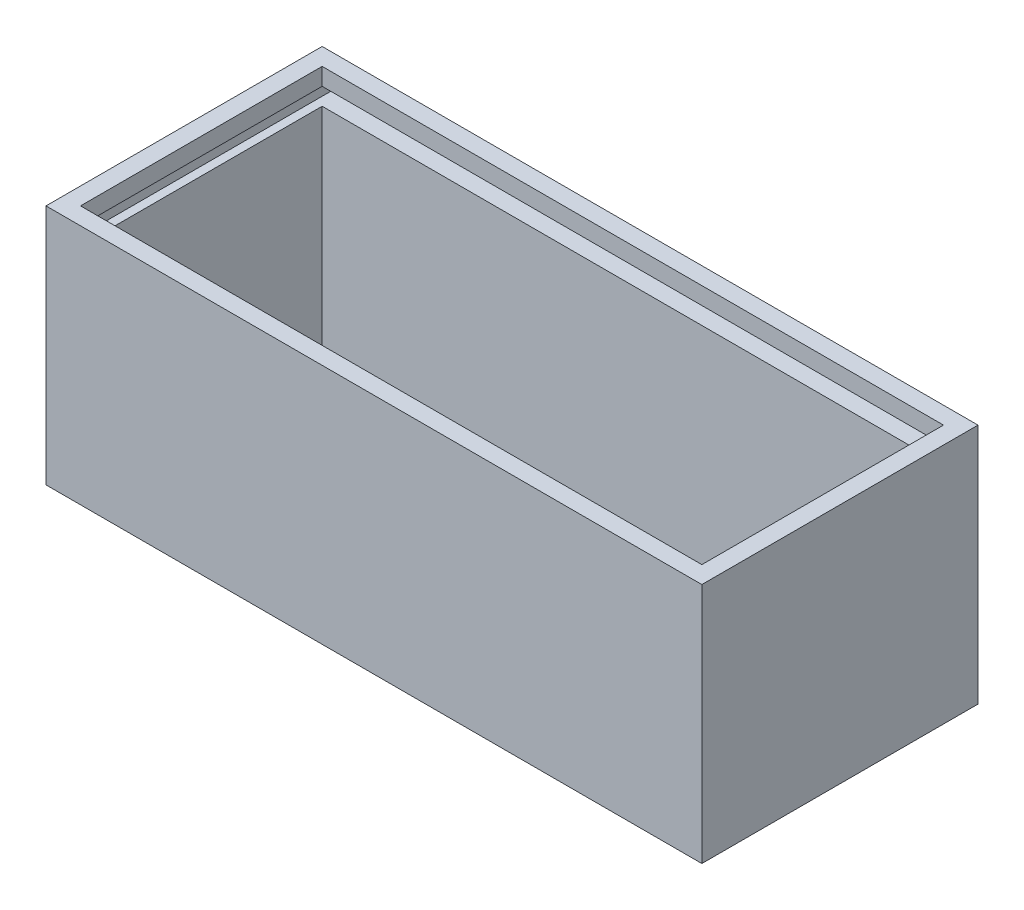
ISO-10303-21;
HEADER;
FILE_DESCRIPTION(('STEP AP214'),'2;1');
FILE_NAME('part.step','',(''),(''),'','','');
FILE_SCHEMA(('AUTOMOTIVE_DESIGN { 1 0 10303 214 1 1 1 1 }'));
ENDSEC;
DATA;
#1=APPLICATION_CONTEXT('core data for automotive mechanical design processes');
#2=APPLICATION_PROTOCOL_DEFINITION('international standard','automotive_design',2000,#1);
#3=PRODUCT_CONTEXT('',#1,'mechanical');
#4=PRODUCT('Part','Part','',(#3));
#5=PRODUCT_RELATED_PRODUCT_CATEGORY('part','',(#4));
#6=PRODUCT_DEFINITION_FORMATION('','',#4);
#7=PRODUCT_DEFINITION_CONTEXT('part definition',#1,'design');
#8=PRODUCT_DEFINITION('design','',#6,#7);
#9=PRODUCT_DEFINITION_SHAPE('','',#8);
#10=(LENGTH_UNIT() NAMED_UNIT(*) SI_UNIT(.MILLI.,.METRE.));
#11=(NAMED_UNIT(*) PLANE_ANGLE_UNIT() SI_UNIT($,.RADIAN.));
#12=(NAMED_UNIT(*) SI_UNIT($,.STERADIAN.) SOLID_ANGLE_UNIT());
#13=UNCERTAINTY_MEASURE_WITH_UNIT(LENGTH_MEASURE(1.E-05),#10,'distance_accuracy_value','');
#14=(GEOMETRIC_REPRESENTATION_CONTEXT(3) GLOBAL_UNCERTAINTY_ASSIGNED_CONTEXT((#13)) GLOBAL_UNIT_ASSIGNED_CONTEXT((#10,
#11,#12)) REPRESENTATION_CONTEXT('',''));
#15=CARTESIAN_POINT('',(0.,0.,0.));
#16=DIRECTION('',(0.,0.,1.));
#17=DIRECTION('',(1.,0.,0.));
#18=AXIS2_PLACEMENT_3D('',#15,#16,#17);
#19=CARTESIAN_POINT('',(0.,70.,-75.));
#20=DIRECTION('',(0.,0.,-1.));
#21=DIRECTION('',(-1.,0.,0.));
#22=AXIS2_PLACEMENT_3D('',#19,#20,#21);
#23=PLANE('',#22);
#24=DIRECTION('',(-1.,0.,0.));
#25=VECTOR('',#24,1.);
#26=CARTESIAN_POINT('',(0.,65.,-75.));
#27=LINE('',#26,#25);
#28=CARTESIAN_POINT('',(185.,65.,-75.));
#29=VERTEX_POINT('',#28);
#30=CARTESIAN_POINT('',(5.,65.,-75.));
#31=VERTEX_POINT('',#30);
#32=EDGE_CURVE('E213',#29,#31,#27,.T.);
#33=ORIENTED_EDGE('',*,*,#32,.F.);
#34=DIRECTION('',(0.,-1.,0.));
#35=VECTOR('',#34,1.);
#36=CARTESIAN_POINT('',(185.,70.,-75.));
#37=LINE('',#36,#35);
#38=CARTESIAN_POINT('',(185.,70.,-75.));
#39=VERTEX_POINT('',#38);
#40=EDGE_CURVE('E297',#39,#29,#37,.T.);
#41=ORIENTED_EDGE('',*,*,#40,.F.);
#42=DIRECTION('',(1.,0.,0.));
#43=VECTOR('',#42,1.);
#44=CARTESIAN_POINT('',(0.,70.,-75.));
#45=LINE('',#44,#43);
#46=CARTESIAN_POINT('',(5.,70.,-75.));
#47=VERTEX_POINT('',#46);
#48=EDGE_CURVE('E236',#47,#39,#45,.T.);
#49=ORIENTED_EDGE('',*,*,#48,.F.);
#50=DIRECTION('',(0.,-1.,0.));
#51=VECTOR('',#50,1.);
#52=CARTESIAN_POINT('',(5.,70.,-75.));
#53=LINE('',#52,#51);
#54=EDGE_CURVE('E282',#47,#31,#53,.T.);
#55=ORIENTED_EDGE('',*,*,#54,.T.);
#56=EDGE_LOOP('',(#33,#41,#49,#55));
#57=FACE_BOUND('',#56,.T.);
#58=ADVANCED_FACE('F39',(#57),#23,.F.);
#59=CARTESIAN_POINT('',(185.,70.,0.));
#60=DIRECTION('',(1.,0.,0.));
#61=DIRECTION('',(0.,0.,-1.));
#62=AXIS2_PLACEMENT_3D('',#59,#60,#61);
#63=PLANE('',#62);
#64=DIRECTION('',(0.,0.,-1.));
#65=VECTOR('',#64,1.);
#66=CARTESIAN_POINT('',(185.,65.,0.));
#67=LINE('',#66,#65);
#68=CARTESIAN_POINT('',(185.,65.,-5.));
#69=VERTEX_POINT('',#68);
#70=EDGE_CURVE('E216',#69,#29,#67,.T.);
#71=ORIENTED_EDGE('',*,*,#70,.F.);
#72=DIRECTION('',(0.,-1.,0.));
#73=VECTOR('',#72,1.);
#74=CARTESIAN_POINT('',(185.,70.,-5.));
#75=LINE('',#74,#73);
#76=CARTESIAN_POINT('',(185.,70.,-5.));
#77=VERTEX_POINT('',#76);
#78=EDGE_CURVE('E293',#77,#69,#75,.T.);
#79=ORIENTED_EDGE('',*,*,#78,.F.);
#80=DIRECTION('',(0.,0.,1.));
#81=VECTOR('',#80,1.);
#82=CARTESIAN_POINT('',(185.,70.,0.));
#83=LINE('',#82,#81);
#84=EDGE_CURVE('E240',#39,#77,#83,.T.);
#85=ORIENTED_EDGE('',*,*,#84,.F.);
#86=ORIENTED_EDGE('',*,*,#40,.T.);
#87=EDGE_LOOP('',(#71,#79,#85,#86));
#88=FACE_BOUND('',#87,.T.);
#89=ADVANCED_FACE('F353',(#88),#63,.F.);
#90=CARTESIAN_POINT('',(5.,70.,0.));
#91=DIRECTION('',(1.,0.,0.));
#92=DIRECTION('',(0.,0.,-1.));
#93=AXIS2_PLACEMENT_3D('',#90,#91,#92);
#94=PLANE('',#93);
#95=DIRECTION('',(0.,-1.,0.));
#96=VECTOR('',#95,1.);
#97=CARTESIAN_POINT('',(5.,70.,-5.));
#98=LINE('',#97,#96);
#99=CARTESIAN_POINT('',(5.,70.,-5.));
#100=VERTEX_POINT('',#99);
#101=CARTESIAN_POINT('',(5.,65.,-5.));
#102=VERTEX_POINT('',#101);
#103=EDGE_CURVE('E288',#100,#102,#98,.T.);
#104=ORIENTED_EDGE('',*,*,#103,.T.);
#105=DIRECTION('',(0.,0.,-1.));
#106=VECTOR('',#105,1.);
#107=CARTESIAN_POINT('',(5.,65.,0.));
#108=LINE('',#107,#106);
#109=EDGE_CURVE('E11',#102,#31,#108,.T.);
#110=ORIENTED_EDGE('',*,*,#109,.T.);
#111=ORIENTED_EDGE('',*,*,#54,.F.);
#112=DIRECTION('',(0.,0.,1.));
#113=VECTOR('',#112,1.);
#114=CARTESIAN_POINT('',(5.,70.,0.));
#115=LINE('',#114,#113);
#116=EDGE_CURVE('E247',#47,#100,#115,.T.);
#117=ORIENTED_EDGE('',*,*,#116,.T.);
#118=EDGE_LOOP('',(#104,#110,#111,#117));
#119=FACE_BOUND('',#118,.T.);
#120=ADVANCED_FACE('F359',(#119),#94,.T.);
#121=CARTESIAN_POINT('',(185.,60.,-75.));
#122=VERTEX_POINT('',#121);
#123=CARTESIAN_POINT('',(185.,0.,-75.));
#124=VERTEX_POINT('',#123);
#125=EDGE_CURVE('E296',#122,#124,#37,.T.);
#126=ORIENTED_EDGE('',*,*,#125,.F.);
#127=DIRECTION('',(-1.,0.,0.));
#128=VECTOR('',#127,1.);
#129=CARTESIAN_POINT('',(0.,60.,-75.));
#130=LINE('',#129,#128);
#131=CARTESIAN_POINT('',(5.,60.,-75.));
#132=VERTEX_POINT('',#131);
#133=EDGE_CURVE('E202',#122,#132,#130,.T.);
#134=ORIENTED_EDGE('',*,*,#133,.T.);
#135=CARTESIAN_POINT('',(5.,0.,-75.));
#136=VERTEX_POINT('',#135);
#137=EDGE_CURVE('E287',#132,#136,#53,.T.);
#138=ORIENTED_EDGE('',*,*,#137,.T.);
#139=DIRECTION('',(1.,0.,0.));
#140=VECTOR('',#139,1.);
#141=CARTESIAN_POINT('',(0.,0.,-75.));
#142=LINE('',#141,#140);
#143=EDGE_CURVE('E267',#136,#124,#142,.T.);
#144=ORIENTED_EDGE('',*,*,#143,.T.);
#145=EDGE_LOOP('',(#126,#134,#138,#144));
#146=FACE_BOUND('',#145,.T.);
#147=ADVANCED_FACE('F318',(#146),#23,.F.);
#148=CARTESIAN_POINT('',(185.,60.,-5.));
#149=VERTEX_POINT('',#148);
#150=CARTESIAN_POINT('',(185.,0.,-5.));
#151=VERTEX_POINT('',#150);
#152=EDGE_CURVE('E292',#149,#151,#75,.T.);
#153=ORIENTED_EDGE('',*,*,#152,.F.);
#154=DIRECTION('',(0.,0.,-1.));
#155=VECTOR('',#154,1.);
#156=CARTESIAN_POINT('',(185.,60.,0.));
#157=LINE('',#156,#155);
#158=EDGE_CURVE('E167',#149,#122,#157,.T.);
#159=ORIENTED_EDGE('',*,*,#158,.T.);
#160=ORIENTED_EDGE('',*,*,#125,.T.);
#161=DIRECTION('',(0.,0.,1.));
#162=VECTOR('',#161,1.);
#163=CARTESIAN_POINT('',(185.,0.,0.));
#164=LINE('',#163,#162);
#165=EDGE_CURVE('E271',#124,#151,#164,.T.);
#166=ORIENTED_EDGE('',*,*,#165,.T.);
#167=EDGE_LOOP('',(#153,#159,#160,#166));
#168=FACE_BOUND('',#167,.T.);
#169=ADVANCED_FACE('F337',(#168),#63,.F.);
#170=CARTESIAN_POINT('',(0.,70.,-5.));
#171=DIRECTION('',(0.,0.,-1.));
#172=DIRECTION('',(-1.,0.,0.));
#173=AXIS2_PLACEMENT_3D('',#170,#171,#172);
#174=PLANE('',#173);
#175=CARTESIAN_POINT('',(5.,60.,-5.));
#176=VERTEX_POINT('',#175);
#177=CARTESIAN_POINT('',(5.,0.,-5.));
#178=VERTEX_POINT('',#177);
#179=EDGE_CURVE('E286',#176,#178,#98,.T.);
#180=ORIENTED_EDGE('',*,*,#179,.F.);
#181=DIRECTION('',(-1.,0.,0.));
#182=VECTOR('',#181,1.);
#183=CARTESIAN_POINT('',(0.,60.,-5.));
#184=LINE('',#183,#182);
#185=CARTESIAN_POINT('',(2.5,60.,-5.));
#186=VERTEX_POINT('',#185);
#187=EDGE_CURVE('E171',#176,#186,#184,.T.);
#188=ORIENTED_EDGE('',*,*,#187,.T.);
#189=DIRECTION('',(0.,-1.,0.));
#190=VECTOR('',#189,1.);
#191=CARTESIAN_POINT('',(2.49999999999998,0.,-5.));
#192=LINE('',#191,#190);
#193=CARTESIAN_POINT('',(2.5,65.,-5.));
#194=VERTEX_POINT('',#193);
#195=EDGE_CURVE('E170',#194,#186,#192,.T.);
#196=ORIENTED_EDGE('',*,*,#195,.F.);
#197=DIRECTION('',(-1.,0.,0.));
#198=VECTOR('',#197,1.);
#199=CARTESIAN_POINT('',(0.,65.,-5.));
#200=LINE('',#199,#198);
#201=EDGE_CURVE('E63',#102,#194,#200,.T.);
#202=ORIENTED_EDGE('',*,*,#201,.F.);
#203=ORIENTED_EDGE('',*,*,#103,.F.);
#204=DIRECTION('',(1.,0.,0.));
#205=VECTOR('',#204,1.);
#206=CARTESIAN_POINT('',(0.,70.,-5.));
#207=LINE('',#206,#205);
#208=EDGE_CURVE('E243',#100,#77,#207,.T.);
#209=ORIENTED_EDGE('',*,*,#208,.T.);
#210=ORIENTED_EDGE('',*,*,#78,.T.);
#211=CARTESIAN_POINT('',(187.5,65.,-5.));
#212=VERTEX_POINT('',#211);
#213=EDGE_CURVE('E161',#212,#69,#200,.T.);
#214=ORIENTED_EDGE('',*,*,#213,.F.);
#215=DIRECTION('',(0.,-1.,0.));
#216=VECTOR('',#215,1.);
#217=CARTESIAN_POINT('',(187.5,0.,-5.));
#218=LINE('',#217,#216);
#219=CARTESIAN_POINT('',(187.5,60.,-5.));
#220=VERTEX_POINT('',#219);
#221=EDGE_CURVE('E155',#212,#220,#218,.T.);
#222=ORIENTED_EDGE('',*,*,#221,.T.);
#223=EDGE_CURVE('E164',#220,#149,#184,.T.);
#224=ORIENTED_EDGE('',*,*,#223,.T.);
#225=ORIENTED_EDGE('',*,*,#152,.T.);
#226=DIRECTION('',(1.,0.,0.));
#227=VECTOR('',#226,1.);
#228=CARTESIAN_POINT('',(0.,0.,-5.));
#229=LINE('',#228,#227);
#230=EDGE_CURVE('E275',#178,#151,#229,.T.);
#231=ORIENTED_EDGE('',*,*,#230,.F.);
#232=EDGE_LOOP('',(#180,#188,#196,#202,#203,#209,#210,#214,#222,#224,#225,#231));
#233=FACE_BOUND('',#232,.T.);
#234=ADVANCED_FACE('F175',(#233),#174,.T.);
#235=CARTESIAN_POINT('',(190.,70.,0.));
#236=DIRECTION('',(1.,0.,0.));
#237=DIRECTION('',(0.,0.,-1.));
#238=AXIS2_PLACEMENT_3D('',#235,#236,#237);
#239=PLANE('',#238);
#240=DIRECTION('',(0.,0.,1.));
#241=VECTOR('',#240,1.);
#242=CARTESIAN_POINT('',(190.,0.,0.));
#243=LINE('',#242,#241);
#244=CARTESIAN_POINT('',(190.,0.,-80.));
#245=VERTEX_POINT('',#244);
#246=CARTESIAN_POINT('',(190.,0.,0.));
#247=VERTEX_POINT('',#246);
#248=EDGE_CURVE('E219',#245,#247,#243,.T.);
#249=ORIENTED_EDGE('',*,*,#248,.F.);
#250=DIRECTION('',(0.,-1.,0.));
#251=VECTOR('',#250,1.);
#252=CARTESIAN_POINT('',(190.,70.,-80.));
#253=LINE('',#252,#251);
#254=CARTESIAN_POINT('',(190.,70.,-80.));
#255=VERTEX_POINT('',#254);
#256=EDGE_CURVE('E309',#255,#245,#253,.T.);
#257=ORIENTED_EDGE('',*,*,#256,.F.);
#258=DIRECTION('',(0.,0.,1.));
#259=VECTOR('',#258,1.);
#260=CARTESIAN_POINT('',(190.,70.,0.));
#261=LINE('',#260,#259);
#262=CARTESIAN_POINT('',(190.,70.,0.));
#263=VERTEX_POINT('',#262);
#264=EDGE_CURVE('E220',#255,#263,#261,.T.);
#265=ORIENTED_EDGE('',*,*,#264,.T.);
#266=DIRECTION('',(0.,-1.,0.));
#267=VECTOR('',#266,1.);
#268=CARTESIAN_POINT('',(190.,70.,0.));
#269=LINE('',#268,#267);
#270=EDGE_CURVE('E251',#263,#247,#269,.T.);
#271=ORIENTED_EDGE('',*,*,#270,.T.);
#272=EDGE_LOOP('',(#249,#257,#265,#271));
#273=FACE_BOUND('',#272,.T.);
#274=ADVANCED_FACE('F41',(#273),#239,.T.);
#275=CARTESIAN_POINT('',(0.,70.,-80.));
#276=DIRECTION('',(0.,0.,-1.));
#277=DIRECTION('',(-1.,0.,0.));
#278=AXIS2_PLACEMENT_3D('',#275,#276,#277);
#279=PLANE('',#278);
#280=DIRECTION('',(0.,-1.,0.));
#281=VECTOR('',#280,1.);
#282=CARTESIAN_POINT('',(187.5,0.,-80.));
#283=LINE('',#282,#281);
#284=CARTESIAN_POINT('',(187.5,65.,-80.));
#285=VERTEX_POINT('',#284);
#286=CARTESIAN_POINT('',(187.5,60.,-80.));
#287=VERTEX_POINT('',#286);
#288=EDGE_CURVE('E55',#285,#287,#283,.T.);
#289=ORIENTED_EDGE('',*,*,#288,.F.);
#290=DIRECTION('',(-1.,0.,0.));
#291=VECTOR('',#290,1.);
#292=CARTESIAN_POINT('',(0.,65.,-80.));
#293=LINE('',#292,#291);
#294=CARTESIAN_POINT('',(2.5,65.,-80.));
#295=VERTEX_POINT('',#294);
#296=EDGE_CURVE('E178',#285,#295,#293,.T.);
#297=ORIENTED_EDGE('',*,*,#296,.T.);
#298=DIRECTION('',(0.,-1.,0.));
#299=VECTOR('',#298,1.);
#300=CARTESIAN_POINT('',(2.49999999999998,0.,-80.));
#301=LINE('',#300,#299);
#302=CARTESIAN_POINT('',(2.5,60.,-80.));
#303=VERTEX_POINT('',#302);
#304=EDGE_CURVE('E183',#295,#303,#301,.T.);
#305=ORIENTED_EDGE('',*,*,#304,.T.);
#306=DIRECTION('',(-1.,0.,0.));
#307=VECTOR('',#306,1.);
#308=CARTESIAN_POINT('',(0.,60.,-80.));
#309=LINE('',#308,#307);
#310=EDGE_CURVE('E193',#287,#303,#309,.T.);
#311=ORIENTED_EDGE('',*,*,#310,.F.);
#312=EDGE_LOOP('',(#289,#297,#305,#311));
#313=FACE_BOUND('',#312,.T.);
#314=DIRECTION('',(1.,0.,0.));
#315=VECTOR('',#314,1.);
#316=CARTESIAN_POINT('',(0.,0.,-80.));
#317=LINE('',#316,#315);
#318=CARTESIAN_POINT('',(0.,0.,-80.));
#319=VERTEX_POINT('',#318);
#320=EDGE_CURVE('E255',#319,#245,#317,.T.);
#321=ORIENTED_EDGE('',*,*,#320,.F.);
#322=DIRECTION('',(0.,-1.,0.));
#323=VECTOR('',#322,1.);
#324=CARTESIAN_POINT('',(0.,70.,-80.));
#325=LINE('',#324,#323);
#326=CARTESIAN_POINT('',(0.,70.,-80.));
#327=VERTEX_POINT('',#326);
#328=EDGE_CURVE('E306',#327,#319,#325,.T.);
#329=ORIENTED_EDGE('',*,*,#328,.F.);
#330=DIRECTION('',(1.,0.,0.));
#331=VECTOR('',#330,1.);
#332=CARTESIAN_POINT('',(0.,70.,-80.));
#333=LINE('',#332,#331);
#334=EDGE_CURVE('E224',#327,#255,#333,.T.);
#335=ORIENTED_EDGE('',*,*,#334,.T.);
#336=ORIENTED_EDGE('',*,*,#256,.T.);
#337=EDGE_LOOP('',(#321,#329,#335,#336));
#338=FACE_BOUND('',#337,.T.);
#339=ADVANCED_FACE('F383',(#313,#338),#279,.T.);
#340=CARTESIAN_POINT('',(0.,70.,0.));
#341=DIRECTION('',(-1.,0.,0.));
#342=DIRECTION('',(0.,0.,1.));
#343=AXIS2_PLACEMENT_3D('',#340,#341,#342);
#344=PLANE('',#343);
#345=DIRECTION('',(0.,0.,-1.));
#346=VECTOR('',#345,1.);
#347=CARTESIAN_POINT('',(0.,0.,0.));
#348=LINE('',#347,#346);
#349=CARTESIAN_POINT('',(0.,0.,0.));
#350=VERTEX_POINT('',#349);
#351=EDGE_CURVE('E259',#350,#319,#348,.T.);
#352=ORIENTED_EDGE('',*,*,#351,.F.);
#353=DIRECTION('',(0.,-1.,0.));
#354=VECTOR('',#353,1.);
#355=CARTESIAN_POINT('',(0.,70.,0.));
#356=LINE('',#355,#354);
#357=CARTESIAN_POINT('',(0.,70.,0.));
#358=VERTEX_POINT('',#357);
#359=EDGE_CURVE('E303',#358,#350,#356,.T.);
#360=ORIENTED_EDGE('',*,*,#359,.F.);
#361=DIRECTION('',(0.,0.,-1.));
#362=VECTOR('',#361,1.);
#363=CARTESIAN_POINT('',(0.,70.,0.));
#364=LINE('',#363,#362);
#365=EDGE_CURVE('E229',#358,#327,#364,.T.);
#366=ORIENTED_EDGE('',*,*,#365,.T.);
#367=ORIENTED_EDGE('',*,*,#328,.T.);
#368=EDGE_LOOP('',(#352,#360,#366,#367));
#369=FACE_BOUND('',#368,.T.);
#370=ADVANCED_FACE('F378',(#369),#344,.T.);
#371=CARTESIAN_POINT('',(0.,70.,0.));
#372=DIRECTION('',(0.,0.,-1.));
#373=DIRECTION('',(-1.,0.,0.));
#374=AXIS2_PLACEMENT_3D('',#371,#372,#373);
#375=PLANE('',#374);
#376=DIRECTION('',(1.,0.,0.));
#377=VECTOR('',#376,1.);
#378=CARTESIAN_POINT('',(0.,0.,0.));
#379=LINE('',#378,#377);
#380=EDGE_CURVE('E263',#350,#247,#379,.T.);
#381=ORIENTED_EDGE('',*,*,#380,.T.);
#382=ORIENTED_EDGE('',*,*,#270,.F.);
#383=DIRECTION('',(1.,0.,0.));
#384=VECTOR('',#383,1.);
#385=CARTESIAN_POINT('',(0.,70.,0.));
#386=LINE('',#385,#384);
#387=EDGE_CURVE('E233',#358,#263,#386,.T.);
#388=ORIENTED_EDGE('',*,*,#387,.F.);
#389=ORIENTED_EDGE('',*,*,#359,.T.);
#390=EDGE_LOOP('',(#381,#382,#388,#389));
#391=FACE_BOUND('',#390,.T.);
#392=ADVANCED_FACE('F374',(#391),#375,.F.);
#393=DIRECTION('',(0.,0.,-1.));
#394=VECTOR('',#393,1.);
#395=CARTESIAN_POINT('',(5.,60.,0.));
#396=LINE('',#395,#394);
#397=EDGE_CURVE('E48',#176,#132,#396,.T.);
#398=ORIENTED_EDGE('',*,*,#397,.F.);
#399=ORIENTED_EDGE('',*,*,#179,.T.);
#400=DIRECTION('',(0.,0.,1.));
#401=VECTOR('',#400,1.);
#402=CARTESIAN_POINT('',(5.,0.,0.));
#403=LINE('',#402,#401);
#404=EDGE_CURVE('E225',#136,#178,#403,.T.);
#405=ORIENTED_EDGE('',*,*,#404,.F.);
#406=ORIENTED_EDGE('',*,*,#137,.F.);
#407=EDGE_LOOP('',(#398,#399,#405,#406));
#408=FACE_BOUND('',#407,.T.);
#409=ADVANCED_FACE('F321',(#408),#94,.T.);
#410=CARTESIAN_POINT('',(0.,70.,0.));
#411=DIRECTION('',(0.,1.,0.));
#412=DIRECTION('',(0.,0.,1.));
#413=AXIS2_PLACEMENT_3D('',#410,#411,#412);
#414=PLANE('',#413);
#415=ORIENTED_EDGE('',*,*,#264,.F.);
#416=ORIENTED_EDGE('',*,*,#334,.F.);
#417=ORIENTED_EDGE('',*,*,#365,.F.);
#418=ORIENTED_EDGE('',*,*,#387,.T.);
#419=EDGE_LOOP('',(#415,#416,#417,#418));
#420=FACE_BOUND('',#419,.T.);
#421=ORIENTED_EDGE('',*,*,#48,.T.);
#422=ORIENTED_EDGE('',*,*,#84,.T.);
#423=ORIENTED_EDGE('',*,*,#208,.F.);
#424=ORIENTED_EDGE('',*,*,#116,.F.);
#425=EDGE_LOOP('',(#421,#422,#423,#424));
#426=FACE_BOUND('',#425,.T.);
#427=ADVANCED_FACE('F341',(#420,#426),#414,.T.);
#428=CARTESIAN_POINT('',(0.,0.,0.));
#429=DIRECTION('',(0.,1.,0.));
#430=DIRECTION('',(0.,0.,1.));
#431=AXIS2_PLACEMENT_3D('',#428,#429,#430);
#432=PLANE('',#431);
#433=ORIENTED_EDGE('',*,*,#248,.T.);
#434=ORIENTED_EDGE('',*,*,#380,.F.);
#435=ORIENTED_EDGE('',*,*,#351,.T.);
#436=ORIENTED_EDGE('',*,*,#320,.T.);
#437=EDGE_LOOP('',(#433,#434,#435,#436));
#438=FACE_BOUND('',#437,.T.);
#439=ORIENTED_EDGE('',*,*,#143,.F.);
#440=ORIENTED_EDGE('',*,*,#404,.T.);
#441=ORIENTED_EDGE('',*,*,#230,.T.);
#442=ORIENTED_EDGE('',*,*,#165,.F.);
#443=EDGE_LOOP('',(#439,#440,#441,#442));
#444=FACE_BOUND('',#443,.T.);
#445=ADVANCED_FACE('F339',(#438,#444),#432,.F.);
#446=CARTESIAN_POINT('',(0.,65.,-5.));
#447=DIRECTION('',(0.,-1.,0.));
#448=DIRECTION('',(0.,0.,-1.));
#449=AXIS2_PLACEMENT_3D('',#446,#447,#448);
#450=PLANE('',#449);
#451=ORIENTED_EDGE('',*,*,#70,.T.);
#452=ORIENTED_EDGE('',*,*,#32,.T.);
#453=ORIENTED_EDGE('',*,*,#109,.F.);
#454=ORIENTED_EDGE('',*,*,#201,.T.);
#455=DIRECTION('',(0.,0.,-1.));
#456=VECTOR('',#455,1.);
#457=CARTESIAN_POINT('',(2.5,65.,-5.));
#458=LINE('',#457,#456);
#459=EDGE_CURVE('E203',#194,#295,#458,.T.);
#460=ORIENTED_EDGE('',*,*,#459,.T.);
#461=ORIENTED_EDGE('',*,*,#296,.F.);
#462=DIRECTION('',(0.,0.,-1.));
#463=VECTOR('',#462,1.);
#464=CARTESIAN_POINT('',(187.5,65.,-5.));
#465=LINE('',#464,#463);
#466=EDGE_CURVE('E199',#212,#285,#465,.T.);
#467=ORIENTED_EDGE('',*,*,#466,.F.);
#468=ORIENTED_EDGE('',*,*,#213,.T.);
#469=EDGE_LOOP('',(#451,#452,#453,#454,#460,#461,#467,#468));
#470=FACE_BOUND('',#469,.T.);
#471=ADVANCED_FACE('F327',(#470),#450,.T.);
#472=CARTESIAN_POINT('',(0.,60.,-5.));
#473=DIRECTION('',(0.,-1.,0.));
#474=DIRECTION('',(0.,0.,-1.));
#475=AXIS2_PLACEMENT_3D('',#472,#473,#474);
#476=PLANE('',#475);
#477=ORIENTED_EDGE('',*,*,#223,.F.);
#478=DIRECTION('',(0.,0.,-1.));
#479=VECTOR('',#478,1.);
#480=CARTESIAN_POINT('',(187.5,60.,-5.));
#481=LINE('',#480,#479);
#482=EDGE_CURVE('E151',#220,#287,#481,.T.);
#483=ORIENTED_EDGE('',*,*,#482,.T.);
#484=ORIENTED_EDGE('',*,*,#310,.T.);
#485=DIRECTION('',(0.,0.,-1.));
#486=VECTOR('',#485,1.);
#487=CARTESIAN_POINT('',(2.5,60.,-5.));
#488=LINE('',#487,#486);
#489=EDGE_CURVE('E160',#186,#303,#488,.T.);
#490=ORIENTED_EDGE('',*,*,#489,.F.);
#491=ORIENTED_EDGE('',*,*,#187,.F.);
#492=ORIENTED_EDGE('',*,*,#397,.T.);
#493=ORIENTED_EDGE('',*,*,#133,.F.);
#494=ORIENTED_EDGE('',*,*,#158,.F.);
#495=EDGE_LOOP('',(#477,#483,#484,#490,#491,#492,#493,#494));
#496=FACE_BOUND('',#495,.T.);
#497=ADVANCED_FACE('F165',(#496),#476,.F.);
#498=CARTESIAN_POINT('',(187.5,0.,-5.));
#499=DIRECTION('',(1.,0.,0.));
#500=DIRECTION('',(0.,0.,-1.));
#501=AXIS2_PLACEMENT_3D('',#498,#499,#500);
#502=PLANE('',#501);
#503=ORIENTED_EDGE('',*,*,#288,.T.);
#504=ORIENTED_EDGE('',*,*,#482,.F.);
#505=ORIENTED_EDGE('',*,*,#221,.F.);
#506=ORIENTED_EDGE('',*,*,#466,.T.);
#507=EDGE_LOOP('',(#503,#504,#505,#506));
#508=FACE_BOUND('',#507,.T.);
#509=ADVANCED_FACE('F153',(#508),#502,.F.);
#510=CARTESIAN_POINT('',(2.49999999999998,0.,-5.));
#511=DIRECTION('',(1.,0.,0.));
#512=DIRECTION('',(0.,1.,0.));
#513=AXIS2_PLACEMENT_3D('',#510,#511,#512);
#514=PLANE('',#513);
#515=ORIENTED_EDGE('',*,*,#304,.F.);
#516=ORIENTED_EDGE('',*,*,#459,.F.);
#517=ORIENTED_EDGE('',*,*,#195,.T.);
#518=ORIENTED_EDGE('',*,*,#489,.T.);
#519=EDGE_LOOP('',(#515,#516,#517,#518));
#520=FACE_BOUND('',#519,.T.);
#521=ADVANCED_FACE('F331',(#520),#514,.T.);
#522=CLOSED_SHELL('',(#58,#89,#120,#147,#169,#234,#274,#339,#370,#392,#409,#427,#445,#471,#497,
#509,#521));
#523=MANIFOLD_SOLID_BREP('B2',#522);
#524=ADVANCED_BREP_SHAPE_REPRESENTATION('',(#18,#523),#14);
#525=SHAPE_DEFINITION_REPRESENTATION(#9,#524);
ENDSEC;
END-ISO-10303-21;
